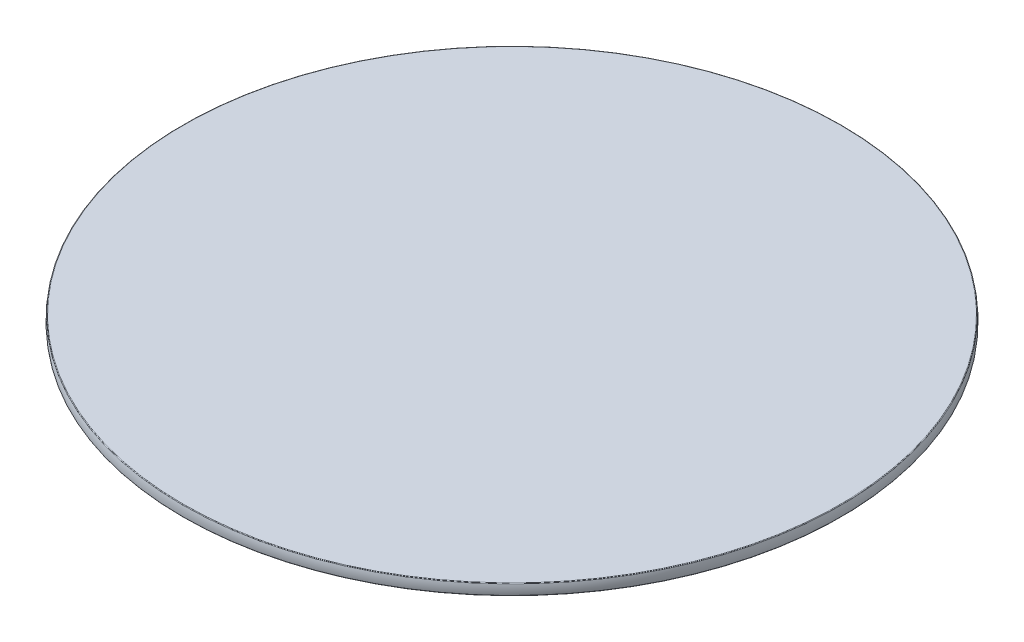
ISO-10303-21;
HEADER;
FILE_DESCRIPTION(('STEP AP214'),'2;1');
FILE_NAME('part.step','',(''),(''),'','','');
FILE_SCHEMA(('AUTOMOTIVE_DESIGN { 1 0 10303 214 1 1 1 1 }'));
ENDSEC;
DATA;
#1=APPLICATION_CONTEXT('core data for automotive mechanical design processes');
#2=APPLICATION_PROTOCOL_DEFINITION('international standard','automotive_design',2000,#1);
#3=PRODUCT_CONTEXT('',#1,'mechanical');
#4=PRODUCT('Part','Part','',(#3));
#5=PRODUCT_RELATED_PRODUCT_CATEGORY('part','',(#4));
#6=PRODUCT_DEFINITION_FORMATION('','',#4);
#7=PRODUCT_DEFINITION_CONTEXT('part definition',#1,'design');
#8=PRODUCT_DEFINITION('design','',#6,#7);
#9=PRODUCT_DEFINITION_SHAPE('','',#8);
#10=(LENGTH_UNIT() NAMED_UNIT(*) SI_UNIT(.MILLI.,.METRE.));
#11=(NAMED_UNIT(*) PLANE_ANGLE_UNIT() SI_UNIT($,.RADIAN.));
#12=(NAMED_UNIT(*) SI_UNIT($,.STERADIAN.) SOLID_ANGLE_UNIT());
#13=UNCERTAINTY_MEASURE_WITH_UNIT(LENGTH_MEASURE(1.E-05),#10,'distance_accuracy_value','');
#14=(GEOMETRIC_REPRESENTATION_CONTEXT(3) GLOBAL_UNCERTAINTY_ASSIGNED_CONTEXT((#13)) GLOBAL_UNIT_ASSIGNED_CONTEXT((#10,
#11,#12)) REPRESENTATION_CONTEXT('',''));
#15=CARTESIAN_POINT('',(0.,0.,0.));
#16=DIRECTION('',(0.,0.,1.));
#17=DIRECTION('',(1.,0.,0.));
#18=AXIS2_PLACEMENT_3D('',#15,#16,#17);
#19=CARTESIAN_POINT('',(0.,0.,0.));
#20=DIRECTION('',(0.,1.,0.));
#21=DIRECTION('',(0.,0.,1.));
#22=AXIS2_PLACEMENT_3D('',#19,#20,#21);
#23=PLANE('',#22);
#24=CARTESIAN_POINT('',(0.,0.,0.));
#25=DIRECTION('',(0.,1.,0.));
#26=DIRECTION('',(0.,0.,1.));
#27=AXIS2_PLACEMENT_3D('',#24,#25,#26);
#28=CIRCLE('',#27,149.491301057757);
#29=CARTESIAN_POINT('',(0.,0.,149.491301057757));
#30=VERTEX_POINT('',#29);
#31=EDGE_CURVE('E45',#30,#30,#28,.F.);
#32=ORIENTED_EDGE('',*,*,#31,.T.);
#33=EDGE_LOOP('',(#32));
#34=FACE_BOUND('',#33,.T.);
#35=ADVANCED_FACE('F30',(#34),#23,.F.);
#36=CARTESIAN_POINT('',(0.,2.49999999999997,0.));
#37=DIRECTION('',(0.,-1.,0.));
#38=DIRECTION('',(0.,0.,-1.));
#39=AXIS2_PLACEMENT_3D('',#36,#37,#38);
#40=TOROIDAL_SURFACE('',#39,138.,12.);
#41=CARTESIAN_POINT('',(0.,0.243589743589775,0.));
#42=DIRECTION('',(0.,1.,0.));
#43=DIRECTION('',(0.,0.,1.));
#44=AXIS2_PLACEMENT_3D('',#41,#42,#43);
#45=CIRCLE('',#44,149.785949802827);
#46=CARTESIAN_POINT('',(0.,0.243589743589775,149.785949802827));
#47=VERTEX_POINT('',#46);
#48=EDGE_CURVE('E37',#47,#47,#45,.T.);
#49=ORIENTED_EDGE('',*,*,#48,.T.);
#50=EDGE_LOOP('',(#49));
#51=FACE_BOUND('',#50,.T.);
#52=CARTESIAN_POINT('',(0.,4.75641025641022,0.));
#53=DIRECTION('',(0.,-1.,0.));
#54=DIRECTION('',(0.,0.,-1.));
#55=AXIS2_PLACEMENT_3D('',#52,#53,#54);
#56=CIRCLE('',#55,149.785949802827);
#57=CARTESIAN_POINT('',(0.,4.75641025641022,-149.785949802827));
#58=VERTEX_POINT('',#57);
#59=EDGE_CURVE('E41',#58,#58,#56,.T.);
#60=ORIENTED_EDGE('',*,*,#59,.T.);
#61=EDGE_LOOP('',(#60));
#62=FACE_BOUND('',#61,.T.);
#63=ADVANCED_FACE('F61',(#51,#62),#40,.T.);
#64=CARTESIAN_POINT('',(0.,5.,0.));
#65=DIRECTION('',(0.,1.,0.));
#66=DIRECTION('',(0.,0.,1.));
#67=AXIS2_PLACEMENT_3D('',#64,#65,#66);
#68=PLANE('',#67);
#69=CARTESIAN_POINT('',(0.,5.,0.));
#70=DIRECTION('',(0.,1.,0.));
#71=DIRECTION('',(0.,0.,1.));
#72=AXIS2_PLACEMENT_3D('',#69,#70,#71);
#73=CIRCLE('',#72,149.491301057757);
#74=CARTESIAN_POINT('',(0.,5.,149.491301057757));
#75=VERTEX_POINT('',#74);
#76=EDGE_CURVE('E10',#75,#75,#73,.T.);
#77=ORIENTED_EDGE('',*,*,#76,.T.);
#78=EDGE_LOOP('',(#77));
#79=FACE_BOUND('',#78,.T.);
#80=ADVANCED_FACE('F54',(#79),#68,.T.);
#81=CARTESIAN_POINT('',(0.,0.3,0.));
#82=DIRECTION('',(0.,1.,0.));
#83=DIRECTION('',(0.,0.,1.));
#84=AXIS2_PLACEMENT_3D('',#81,#82,#83);
#85=TOROIDAL_SURFACE('',#84,149.491301057757,0.3);
#86=ORIENTED_EDGE('',*,*,#48,.F.);
#87=EDGE_LOOP('',(#86));
#88=FACE_BOUND('',#87,.T.);
#89=ORIENTED_EDGE('',*,*,#31,.F.);
#90=EDGE_LOOP('',(#89));
#91=FACE_BOUND('',#90,.T.);
#92=ADVANCED_FACE('F52',(#88,#91),#85,.T.);
#93=CARTESIAN_POINT('',(0.,4.7,0.));
#94=DIRECTION('',(0.,1.,0.));
#95=DIRECTION('',(0.,0.,1.));
#96=AXIS2_PLACEMENT_3D('',#93,#94,#95);
#97=TOROIDAL_SURFACE('',#96,149.491301057757,0.3);
#98=ORIENTED_EDGE('',*,*,#76,.F.);
#99=EDGE_LOOP('',(#98));
#100=FACE_BOUND('',#99,.T.);
#101=ORIENTED_EDGE('',*,*,#59,.F.);
#102=EDGE_LOOP('',(#101));
#103=FACE_BOUND('',#102,.T.);
#104=ADVANCED_FACE('F32',(#100,#103),#97,.T.);
#105=CLOSED_SHELL('',(#35,#63,#80,#92,#104));
#106=MANIFOLD_SOLID_BREP('B2',#105);
#107=ADVANCED_BREP_SHAPE_REPRESENTATION('',(#18,#106),#14);
#108=SHAPE_DEFINITION_REPRESENTATION(#9,#107);
ENDSEC;
END-ISO-10303-21;
